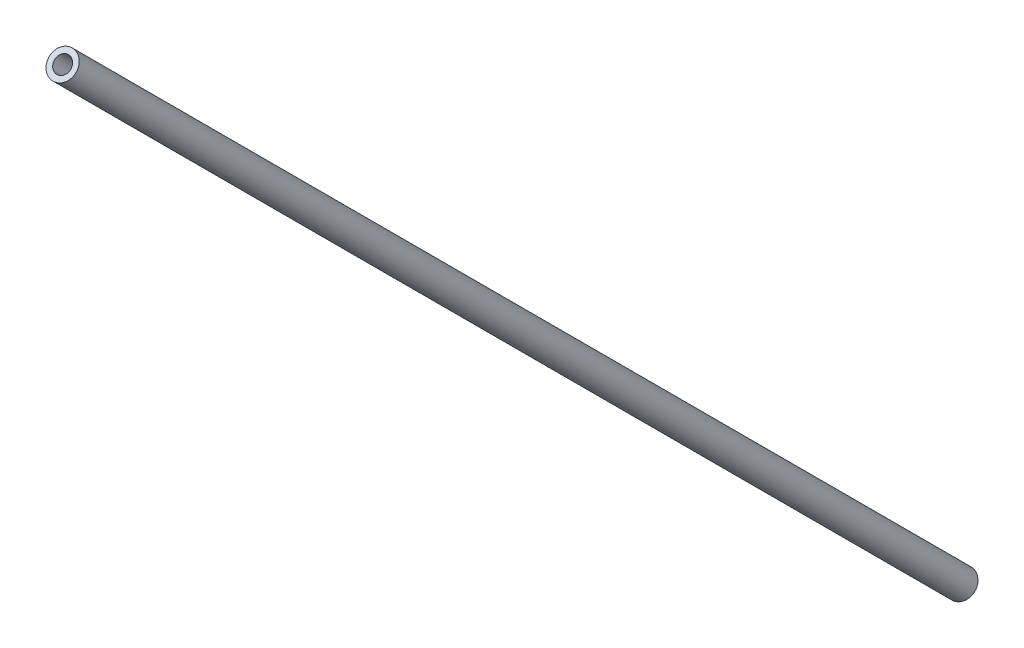
ISO-10303-21;
HEADER;
FILE_DESCRIPTION(('STEP AP214'),'2;1');
FILE_NAME('part.step','',(''),(''),'','','');
FILE_SCHEMA(('AUTOMOTIVE_DESIGN { 1 0 10303 214 1 1 1 1 }'));
ENDSEC;
DATA;
#1=APPLICATION_CONTEXT('core data for automotive mechanical design processes');
#2=APPLICATION_PROTOCOL_DEFINITION('international standard','automotive_design',2000,#1);
#3=PRODUCT_CONTEXT('',#1,'mechanical');
#4=PRODUCT('Part','Part','',(#3));
#5=PRODUCT_RELATED_PRODUCT_CATEGORY('part','',(#4));
#6=PRODUCT_DEFINITION_FORMATION('','',#4);
#7=PRODUCT_DEFINITION_CONTEXT('part definition',#1,'design');
#8=PRODUCT_DEFINITION('design','',#6,#7);
#9=PRODUCT_DEFINITION_SHAPE('','',#8);
#10=(LENGTH_UNIT() NAMED_UNIT(*) SI_UNIT(.MILLI.,.METRE.));
#11=(NAMED_UNIT(*) PLANE_ANGLE_UNIT() SI_UNIT($,.RADIAN.));
#12=(NAMED_UNIT(*) SI_UNIT($,.STERADIAN.) SOLID_ANGLE_UNIT());
#13=UNCERTAINTY_MEASURE_WITH_UNIT(LENGTH_MEASURE(1.E-05),#10,'distance_accuracy_value','');
#14=(GEOMETRIC_REPRESENTATION_CONTEXT(3) GLOBAL_UNCERTAINTY_ASSIGNED_CONTEXT((#13)) GLOBAL_UNIT_ASSIGNED_CONTEXT((#10,
#11,#12)) REPRESENTATION_CONTEXT('',''));
#15=CARTESIAN_POINT('',(0.,0.,0.));
#16=DIRECTION('',(0.,0.,1.));
#17=DIRECTION('',(1.,0.,0.));
#18=AXIS2_PLACEMENT_3D('',#15,#16,#17);
#19=CARTESIAN_POINT('',(8.96784,175.498628385719,109.549875340051));
#20=DIRECTION('',(0.,0.707106781186549,0.707106781186546));
#21=DIRECTION('',(0.,-0.707106781186546,0.707106781186549));
#22=AXIS2_PLACEMENT_3D('',#19,#20,#21);
#23=PLANE('',#22);
#24=CARTESIAN_POINT('',(8.96784,173.730861432753,111.317642293017));
#25=DIRECTION('',(0.,-0.707106781186549,-0.707106781186546));
#26=DIRECTION('',(0.,0.707106781186546,-0.707106781186549));
#27=AXIS2_PLACEMENT_3D('',#24,#25,#26);
#28=CIRCLE('',#27,1.50000000000004);
#29=CARTESIAN_POINT('',(8.96784,174.791521604532,110.256982121237));
#30=VERTEX_POINT('',#29);
#31=EDGE_CURVE('E10',#30,#30,#28,.T.);
#32=ORIENTED_EDGE('',*,*,#31,.T.);
#33=EDGE_LOOP('',(#32));
#34=FACE_BOUND('',#33,.T.);
#35=CARTESIAN_POINT('',(8.96784,173.730861432753,111.317642293017));
#36=DIRECTION('',(0.,-0.707106781186549,-0.707106781186546));
#37=DIRECTION('',(0.,0.707106781186546,-0.707106781186549));
#38=AXIS2_PLACEMENT_3D('',#35,#36,#37);
#39=CIRCLE('',#38,2.50000000000002);
#40=CARTESIAN_POINT('',(8.96784,175.498628385719,109.549875340051));
#41=VERTEX_POINT('',#40);
#42=EDGE_CURVE('E45',#41,#41,#39,.T.);
#43=ORIENTED_EDGE('',*,*,#42,.F.);
#44=EDGE_LOOP('',(#43));
#45=FACE_BOUND('',#44,.T.);
#46=ADVANCED_FACE('F31',(#34,#45),#23,.T.);
#47=CARTESIAN_POINT('',(8.96784,2.61102038560757,-59.8021987541274));
#48=DIRECTION('',(0.,-0.707106781186549,-0.707106781186546));
#49=DIRECTION('',(0.,0.707106781186546,-0.707106781186549));
#50=AXIS2_PLACEMENT_3D('',#47,#48,#49);
#51=CYLINDRICAL_SURFACE('',#50,1.50000000000007);
#52=CARTESIAN_POINT('',(8.96784,8.26787463509994,-54.145344504635));
#53=DIRECTION('',(0.,-0.707106781186549,-0.707106781186546));
#54=DIRECTION('',(0.,0.707106781186546,-0.707106781186549));
#55=AXIS2_PLACEMENT_3D('',#52,#53,#54);
#56=CIRCLE('',#55,1.50000000000008);
#57=CARTESIAN_POINT('',(8.96784,9.32853480687981,-55.2060046764149));
#58=VERTEX_POINT('',#57);
#59=EDGE_CURVE('E37',#58,#58,#56,.T.);
#60=ORIENTED_EDGE('',*,*,#59,.T.);
#61=EDGE_LOOP('',(#60));
#62=FACE_BOUND('',#61,.T.);
#63=ORIENTED_EDGE('',*,*,#31,.F.);
#64=EDGE_LOOP('',(#63));
#65=FACE_BOUND('',#64,.T.);
#66=ADVANCED_FACE('F55',(#62,#65),#51,.F.);
#67=CARTESIAN_POINT('',(8.96784,10.0356415880663,-55.9131114576014));
#68=DIRECTION('',(0.,-0.707106781186549,-0.707106781186546));
#69=DIRECTION('',(0.,0.707106781186546,-0.707106781186549));
#70=AXIS2_PLACEMENT_3D('',#67,#68,#69);
#71=PLANE('',#70);
#72=CARTESIAN_POINT('',(8.96784,8.26787463509996,-54.145344504635));
#73=DIRECTION('',(0.,-0.707106781186549,-0.707106781186546));
#74=DIRECTION('',(0.,0.707106781186546,-0.707106781186549));
#75=AXIS2_PLACEMENT_3D('',#72,#73,#74);
#76=CIRCLE('',#75,2.50000000000002);
#77=CARTESIAN_POINT('',(8.96784,10.0356415880663,-55.9131114576014));
#78=VERTEX_POINT('',#77);
#79=EDGE_CURVE('E41',#78,#78,#76,.T.);
#80=ORIENTED_EDGE('',*,*,#79,.T.);
#81=EDGE_LOOP('',(#80));
#82=FACE_BOUND('',#81,.T.);
#83=ORIENTED_EDGE('',*,*,#59,.F.);
#84=EDGE_LOOP('',(#83));
#85=FACE_BOUND('',#84,.T.);
#86=ADVANCED_FACE('F59',(#82,#85),#71,.T.);
#87=CARTESIAN_POINT('',(8.96784,2.61102038560757,-59.8021987541274));
#88=DIRECTION('',(0.,-0.707106781186549,-0.707106781186546));
#89=DIRECTION('',(0.,0.707106781186546,-0.707106781186549));
#90=AXIS2_PLACEMENT_3D('',#87,#88,#89);
#91=CYLINDRICAL_SURFACE('',#90,2.50000000000002);
#92=ORIENTED_EDGE('',*,*,#42,.T.);
#93=EDGE_LOOP('',(#92));
#94=FACE_BOUND('',#93,.T.);
#95=ORIENTED_EDGE('',*,*,#79,.F.);
#96=EDGE_LOOP('',(#95));
#97=FACE_BOUND('',#96,.T.);
#98=ADVANCED_FACE('F51',(#94,#97),#91,.T.);
#99=CLOSED_SHELL('',(#46,#66,#86,#98));
#100=MANIFOLD_SOLID_BREP('B2',#99);
#101=ADVANCED_BREP_SHAPE_REPRESENTATION('',(#18,#100),#14);
#102=SHAPE_DEFINITION_REPRESENTATION(#9,#101);
ENDSEC;
END-ISO-10303-21;
